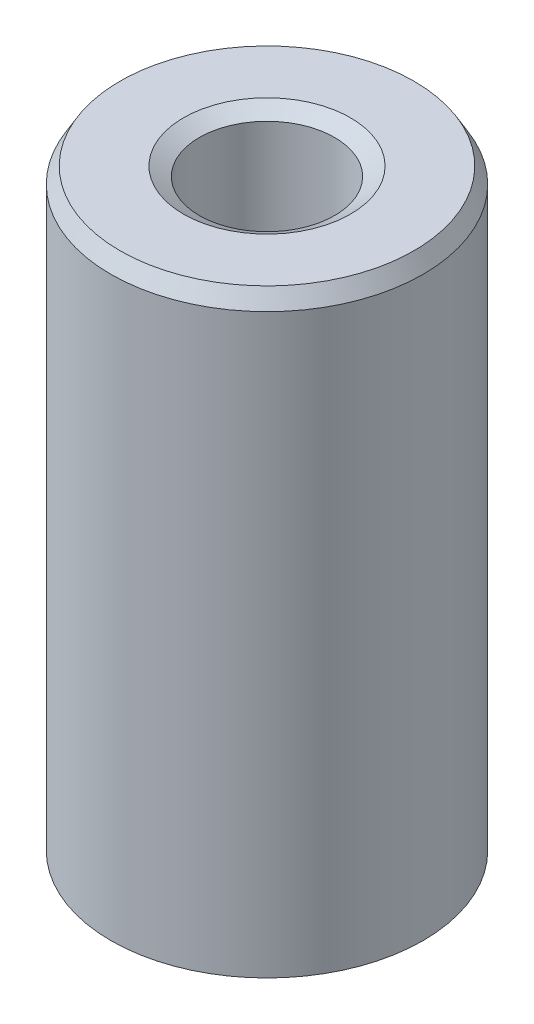
ISO-10303-21;
HEADER;
FILE_DESCRIPTION(('STEP AP214'),'2;1');
FILE_NAME('part.step','',(''),(''),'','','');
FILE_SCHEMA(('AUTOMOTIVE_DESIGN { 1 0 10303 214 1 1 1 1 }'));
ENDSEC;
DATA;
#1=APPLICATION_CONTEXT('core data for automotive mechanical design processes');
#2=APPLICATION_PROTOCOL_DEFINITION('international standard','automotive_design',2000,#1);
#3=PRODUCT_CONTEXT('',#1,'mechanical');
#4=PRODUCT('Part','Part','',(#3));
#5=PRODUCT_RELATED_PRODUCT_CATEGORY('part','',(#4));
#6=PRODUCT_DEFINITION_FORMATION('','',#4);
#7=PRODUCT_DEFINITION_CONTEXT('part definition',#1,'design');
#8=PRODUCT_DEFINITION('design','',#6,#7);
#9=PRODUCT_DEFINITION_SHAPE('','',#8);
#10=(LENGTH_UNIT() NAMED_UNIT(*) SI_UNIT(.MILLI.,.METRE.));
#11=(NAMED_UNIT(*) PLANE_ANGLE_UNIT() SI_UNIT($,.RADIAN.));
#12=(NAMED_UNIT(*) SI_UNIT($,.STERADIAN.) SOLID_ANGLE_UNIT());
#13=UNCERTAINTY_MEASURE_WITH_UNIT(LENGTH_MEASURE(1.E-05),#10,'distance_accuracy_value','');
#14=(GEOMETRIC_REPRESENTATION_CONTEXT(3) GLOBAL_UNCERTAINTY_ASSIGNED_CONTEXT((#13)) GLOBAL_UNIT_ASSIGNED_CONTEXT((#10,
#11,#12)) REPRESENTATION_CONTEXT('',''));
#15=CARTESIAN_POINT('',(0.,0.,0.));
#16=DIRECTION('',(0.,0.,1.));
#17=DIRECTION('',(1.,0.,0.));
#18=AXIS2_PLACEMENT_3D('',#15,#16,#17);
#19=CARTESIAN_POINT('',(0.,67.4984820866277,0.));
#20=DIRECTION('',(0.,-1.,0.));
#21=DIRECTION('',(0.,0.,-1.));
#22=AXIS2_PLACEMENT_3D('',#19,#20,#21);
#23=CYLINDRICAL_SURFACE('',#22,17.5);
#24=CARTESIAN_POINT('',(0.,1.02528297578962,0.));
#25=DIRECTION('',(0.,1.,0.));
#26=DIRECTION('',(0.,0.,1.));
#27=AXIS2_PLACEMENT_3D('',#24,#25,#26);
#28=CIRCLE('',#27,17.5);
#29=CARTESIAN_POINT('',(0.,1.02528297578962,17.5));
#30=VERTEX_POINT('',#29);
#31=EDGE_CURVE('E10',#30,#30,#28,.T.);
#32=ORIENTED_EDGE('',*,*,#31,.T.);
#33=EDGE_LOOP('',(#32));
#34=FACE_BOUND('',#33,.T.);
#35=CARTESIAN_POINT('',(0.,65.7226398804247,0.));
#36=DIRECTION('',(0.,1.,0.));
#37=DIRECTION('',(0.,0.,1.));
#38=AXIS2_PLACEMENT_3D('',#35,#36,#37);
#39=CIRCLE('',#38,17.5);
#40=CARTESIAN_POINT('',(0.,65.7226398804247,17.5));
#41=VERTEX_POINT('',#40);
#42=EDGE_CURVE('E50',#41,#41,#39,.F.);
#43=ORIENTED_EDGE('',*,*,#42,.T.);
#44=EDGE_LOOP('',(#43));
#45=FACE_BOUND('',#44,.T.);
#46=ADVANCED_FACE('F39',(#34,#45),#23,.T.);
#47=CARTESIAN_POINT('',(0.,67.4984820866277,0.));
#48=DIRECTION('',(0.,1.,0.));
#49=DIRECTION('',(0.,0.,1.));
#50=AXIS2_PLACEMENT_3D('',#47,#48,#49);
#51=PLANE('',#50);
#52=CARTESIAN_POINT('',(0.,67.4984820866277,0.));
#53=DIRECTION('',(0.,1.,0.));
#54=DIRECTION('',(0.,0.,1.));
#55=AXIS2_PLACEMENT_3D('',#52,#53,#54);
#56=CIRCLE('',#55,9.36301988105752);
#57=CARTESIAN_POINT('',(0.,67.4984820866277,9.36301988105752));
#58=VERTEX_POINT('',#57);
#59=EDGE_CURVE('E58',#58,#58,#56,.F.);
#60=ORIENTED_EDGE('',*,*,#59,.T.);
#61=EDGE_LOOP('',(#60));
#62=FACE_BOUND('',#61,.T.);
#63=CARTESIAN_POINT('',(0.,67.4984820866277,0.));
#64=DIRECTION('',(0.,1.,0.));
#65=DIRECTION('',(0.,0.,1.));
#66=AXIS2_PLACEMENT_3D('',#63,#64,#65);
#67=CIRCLE('',#66,16.4747170242104);
#68=CARTESIAN_POINT('',(0.,67.4984820866277,16.4747170242104));
#69=VERTEX_POINT('',#68);
#70=EDGE_CURVE('E61',#69,#69,#67,.T.);
#71=ORIENTED_EDGE('',*,*,#70,.T.);
#72=EDGE_LOOP('',(#71));
#73=FACE_BOUND('',#72,.T.);
#74=ADVANCED_FACE('F88',(#62,#73),#51,.T.);
#75=CARTESIAN_POINT('',(0.,0.,0.));
#76=DIRECTION('',(0.,1.,0.));
#77=DIRECTION('',(0.,0.,1.));
#78=AXIS2_PLACEMENT_3D('',#75,#76,#77);
#79=PLANE('',#78);
#80=CARTESIAN_POINT('',(0.,0.,0.));
#81=DIRECTION('',(0.,1.,0.));
#82=DIRECTION('',(0.,0.,1.));
#83=AXIS2_PLACEMENT_3D('',#80,#81,#82);
#84=CIRCLE('',#83,8.61246065064408);
#85=CARTESIAN_POINT('',(0.,0.,8.61246065064408));
#86=VERTEX_POINT('',#85);
#87=EDGE_CURVE('E51',#86,#86,#84,.T.);
#88=ORIENTED_EDGE('',*,*,#87,.T.);
#89=EDGE_LOOP('',(#88));
#90=FACE_BOUND('',#89,.T.);
#91=CARTESIAN_POINT('',(0.,0.,0.));
#92=DIRECTION('',(0.,1.,0.));
#93=DIRECTION('',(0.,0.,1.));
#94=AXIS2_PLACEMENT_3D('',#91,#92,#93);
#95=CIRCLE('',#94,15.7241577937969);
#96=CARTESIAN_POINT('',(0.,0.,15.7241577937969));
#97=VERTEX_POINT('',#96);
#98=EDGE_CURVE('E54',#97,#97,#95,.F.);
#99=ORIENTED_EDGE('',*,*,#98,.T.);
#100=EDGE_LOOP('',(#99));
#101=FACE_BOUND('',#100,.T.);
#102=ADVANCED_FACE('F83',(#90,#101),#79,.F.);
#103=CARTESIAN_POINT('',(0.,67.4984820866277,0.));
#104=DIRECTION('',(0.,-1.,0.));
#105=DIRECTION('',(0.,0.,-1.));
#106=AXIS2_PLACEMENT_3D('',#103,#104,#105);
#107=CYLINDRICAL_SURFACE('',#106,7.58717767485444);
#108=CARTESIAN_POINT('',(0.,66.4731991108381,0.));
#109=DIRECTION('',(0.,1.,0.));
#110=DIRECTION('',(0.,0.,1.));
#111=AXIS2_PLACEMENT_3D('',#108,#109,#110);
#112=CIRCLE('',#111,7.58717767485444);
#113=CARTESIAN_POINT('',(0.,66.4731991108381,7.58717767485444));
#114=VERTEX_POINT('',#113);
#115=EDGE_CURVE('E67',#114,#114,#112,.T.);
#116=ORIENTED_EDGE('',*,*,#115,.T.);
#117=EDGE_LOOP('',(#116));
#118=FACE_BOUND('',#117,.T.);
#119=CARTESIAN_POINT('',(0.,1.77584220620307,0.));
#120=DIRECTION('',(0.,1.,0.));
#121=DIRECTION('',(0.,0.,1.));
#122=AXIS2_PLACEMENT_3D('',#119,#120,#121);
#123=CIRCLE('',#122,7.58717767485444);
#124=CARTESIAN_POINT('',(0.,1.77584220620307,7.58717767485444));
#125=VERTEX_POINT('',#124);
#126=EDGE_CURVE('E69',#125,#125,#123,.F.);
#127=ORIENTED_EDGE('',*,*,#126,.T.);
#128=EDGE_LOOP('',(#127));
#129=FACE_BOUND('',#128,.T.);
#130=ADVANCED_FACE('F71',(#118,#129),#107,.F.);
#131=CARTESIAN_POINT('',(0.,66.4731991108381,0.));
#132=DIRECTION('',(0.,1.,0.));
#133=DIRECTION('',(0.,0.,1.));
#134=AXIS2_PLACEMENT_3D('',#131,#132,#133);
#135=CONICAL_SURFACE('',#134,7.58717767485444,1.0471975511966);
#136=ORIENTED_EDGE('',*,*,#59,.F.);
#137=EDGE_LOOP('',(#136));
#138=FACE_BOUND('',#137,.T.);
#139=ORIENTED_EDGE('',*,*,#115,.F.);
#140=EDGE_LOOP('',(#139));
#141=FACE_BOUND('',#140,.T.);
#142=ADVANCED_FACE('F77',(#138,#141),#135,.F.);
#143=CARTESIAN_POINT('',(0.,0.,0.));
#144=DIRECTION('',(0.,-1.,0.));
#145=DIRECTION('',(0.,0.,-1.));
#146=AXIS2_PLACEMENT_3D('',#143,#144,#145);
#147=CONICAL_SURFACE('',#146,8.61246065064408,0.523598775598297);
#148=ORIENTED_EDGE('',*,*,#126,.F.);
#149=EDGE_LOOP('',(#148));
#150=FACE_BOUND('',#149,.T.);
#151=ORIENTED_EDGE('',*,*,#87,.F.);
#152=EDGE_LOOP('',(#151));
#153=FACE_BOUND('',#152,.T.);
#154=ADVANCED_FACE('F73',(#150,#153),#147,.F.);
#155=CARTESIAN_POINT('',(0.,1.02528297578962,0.));
#156=DIRECTION('',(0.,1.,0.));
#157=DIRECTION('',(0.,0.,1.));
#158=AXIS2_PLACEMENT_3D('',#155,#156,#157);
#159=CONICAL_SURFACE('',#158,17.5,1.0471975511966);
#160=ORIENTED_EDGE('',*,*,#98,.F.);
#161=EDGE_LOOP('',(#160));
#162=FACE_BOUND('',#161,.T.);
#163=ORIENTED_EDGE('',*,*,#31,.F.);
#164=EDGE_LOOP('',(#163));
#165=FACE_BOUND('',#164,.T.);
#166=ADVANCED_FACE('F76',(#162,#165),#159,.T.);
#167=CARTESIAN_POINT('',(0.,67.4984820866277,0.));
#168=DIRECTION('',(0.,-1.,0.));
#169=DIRECTION('',(0.,0.,-1.));
#170=AXIS2_PLACEMENT_3D('',#167,#168,#169);
#171=CONICAL_SURFACE('',#170,16.4747170242104,0.523598775598297);
#172=ORIENTED_EDGE('',*,*,#42,.F.);
#173=EDGE_LOOP('',(#172));
#174=FACE_BOUND('',#173,.T.);
#175=ORIENTED_EDGE('',*,*,#70,.F.);
#176=EDGE_LOOP('',(#175));
#177=FACE_BOUND('',#176,.T.);
#178=ADVANCED_FACE('F45',(#174,#177),#171,.T.);
#179=CLOSED_SHELL('',(#46,#74,#102,#130,#142,#154,#166,#178));
#180=MANIFOLD_SOLID_BREP('B2',#179);
#181=ADVANCED_BREP_SHAPE_REPRESENTATION('',(#18,#180),#14);
#182=SHAPE_DEFINITION_REPRESENTATION(#9,#181);
ENDSEC;
END-ISO-10303-21;
